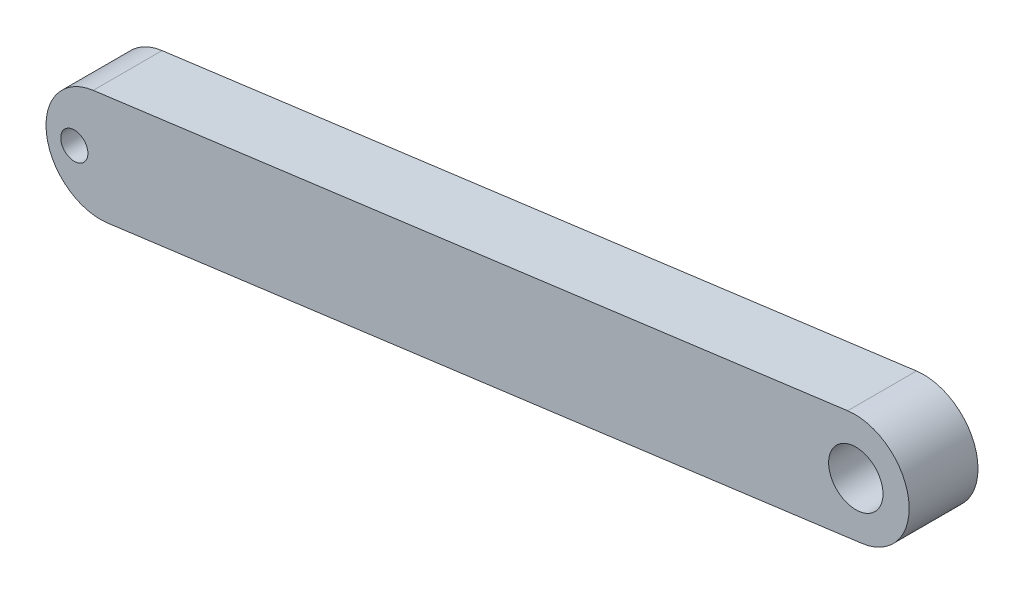
ISO-10303-21;
HEADER;
FILE_DESCRIPTION(('STEP AP214'),'2;1');
FILE_NAME('part.step','',(''),(''),'','','');
FILE_SCHEMA(('AUTOMOTIVE_DESIGN { 1 0 10303 214 1 1 1 1 }'));
ENDSEC;
DATA;
#1=APPLICATION_CONTEXT('core data for automotive mechanical design processes');
#2=APPLICATION_PROTOCOL_DEFINITION('international standard','automotive_design',2000,#1);
#3=PRODUCT_CONTEXT('',#1,'mechanical');
#4=PRODUCT('Part','Part','',(#3));
#5=PRODUCT_RELATED_PRODUCT_CATEGORY('part','',(#4));
#6=PRODUCT_DEFINITION_FORMATION('','',#4);
#7=PRODUCT_DEFINITION_CONTEXT('part definition',#1,'design');
#8=PRODUCT_DEFINITION('design','',#6,#7);
#9=PRODUCT_DEFINITION_SHAPE('','',#8);
#10=(LENGTH_UNIT() NAMED_UNIT(*) SI_UNIT(.MILLI.,.METRE.));
#11=(NAMED_UNIT(*) PLANE_ANGLE_UNIT() SI_UNIT($,.RADIAN.));
#12=(NAMED_UNIT(*) SI_UNIT($,.STERADIAN.) SOLID_ANGLE_UNIT());
#13=UNCERTAINTY_MEASURE_WITH_UNIT(LENGTH_MEASURE(1.E-05),#10,'distance_accuracy_value','');
#14=(GEOMETRIC_REPRESENTATION_CONTEXT(3) GLOBAL_UNCERTAINTY_ASSIGNED_CONTEXT((#13)) GLOBAL_UNIT_ASSIGNED_CONTEXT((#10,
#11,#12)) REPRESENTATION_CONTEXT('',''));
#15=CARTESIAN_POINT('',(0.,0.,0.));
#16=DIRECTION('',(0.,0.,1.));
#17=DIRECTION('',(1.,0.,0.));
#18=AXIS2_PLACEMENT_3D('',#15,#16,#17);
#19=CARTESIAN_POINT('',(4803.77362647582,-1072.12790132437,380.));
#20=DIRECTION('',(0.,0.,-1.));
#21=DIRECTION('',(-1.,0.,0.));
#22=AXIS2_PLACEMENT_3D('',#19,#20,#21);
#23=CYLINDRICAL_SURFACE('',#22,299.999999999994);
#24=CARTESIAN_POINT('',(4803.77362647582,-1072.12790132437,0.));
#25=DIRECTION('',(0.,0.,1.));
#26=DIRECTION('',(1.,0.,0.));
#27=AXIS2_PLACEMENT_3D('',#24,#25,#26);
#28=CIRCLE('',#27,299.999999999994);
#29=CARTESIAN_POINT('',(4843.0953105915,-1369.53974567208,0.));
#30=VERTEX_POINT('',#29);
#31=CARTESIAN_POINT('',(4764.45194236014,-774.716056976667,0.));
#32=VERTEX_POINT('',#31);
#33=EDGE_CURVE('E102',#30,#32,#28,.T.);
#34=ORIENTED_EDGE('',*,*,#33,.T.);
#35=DIRECTION('',(0.,0.,-1.));
#36=VECTOR('',#35,1.);
#37=CARTESIAN_POINT('',(4764.45194236014,-774.716056976667,380.));
#38=LINE('',#37,#36);
#39=CARTESIAN_POINT('',(4764.45194236014,-774.716056976667,380.));
#40=VERTEX_POINT('',#39);
#41=EDGE_CURVE('E11',#40,#32,#38,.T.);
#42=ORIENTED_EDGE('',*,*,#41,.F.);
#43=CARTESIAN_POINT('',(4803.77362647582,-1072.12790132437,380.));
#44=DIRECTION('',(0.,0.,1.));
#45=DIRECTION('',(1.,0.,0.));
#46=AXIS2_PLACEMENT_3D('',#43,#44,#45);
#47=CIRCLE('',#46,299.999999999994);
#48=CARTESIAN_POINT('',(4843.0953105915,-1369.53974567208,380.));
#49=VERTEX_POINT('',#48);
#50=EDGE_CURVE('E88',#49,#40,#47,.T.);
#51=ORIENTED_EDGE('',*,*,#50,.F.);
#52=DIRECTION('',(0.,0.,-1.));
#53=VECTOR('',#52,1.);
#54=CARTESIAN_POINT('',(4843.0953105915,-1369.53974567208,380.));
#55=LINE('',#54,#53);
#56=EDGE_CURVE('E55',#49,#30,#55,.T.);
#57=ORIENTED_EDGE('',*,*,#56,.T.);
#58=EDGE_LOOP('',(#34,#42,#51,#57));
#59=FACE_BOUND('',#58,.T.);
#60=ADVANCED_FACE('F39',(#59),#23,.T.);
#61=CARTESIAN_POINT('',(4764.45194236014,-774.716056976667,380.));
#62=DIRECTION('',(0.1310722803856,-0.991372814492368,0.));
#63=DIRECTION('',(0.991372814492368,0.1310722803856,0.));
#64=AXIS2_PLACEMENT_3D('',#61,#62,#63);
#65=PLANE('',#64);
#66=DIRECTION('',(-0.991372814492368,-0.1310722803856,0.));
#67=VECTOR('',#66,1.);
#68=CARTESIAN_POINT('',(4764.45194236014,-774.716056976667,0.));
#69=LINE('',#68,#67);
#70=CARTESIAN_POINT('',(600.686121492195,-1325.21963459619,0.));
#71=VERTEX_POINT('',#70);
#72=EDGE_CURVE('E93',#32,#71,#69,.T.);
#73=ORIENTED_EDGE('',*,*,#72,.T.);
#74=DIRECTION('',(0.,0.,-1.));
#75=VECTOR('',#74,1.);
#76=CARTESIAN_POINT('',(600.686121492195,-1325.21963459619,380.));
#77=LINE('',#76,#75);
#78=CARTESIAN_POINT('',(600.686121492195,-1325.21963459619,380.));
#79=VERTEX_POINT('',#78);
#80=EDGE_CURVE('E47',#79,#71,#77,.T.);
#81=ORIENTED_EDGE('',*,*,#80,.F.);
#82=DIRECTION('',(-0.991372814492368,-0.1310722803856,0.));
#83=VECTOR('',#82,1.);
#84=CARTESIAN_POINT('',(4764.45194236014,-774.716056976667,380.));
#85=LINE('',#84,#83);
#86=EDGE_CURVE('E81',#40,#79,#85,.T.);
#87=ORIENTED_EDGE('',*,*,#86,.F.);
#88=ORIENTED_EDGE('',*,*,#41,.T.);
#89=EDGE_LOOP('',(#73,#81,#87,#88));
#90=FACE_BOUND('',#89,.T.);
#91=ADVANCED_FACE('F92',(#90),#65,.F.);
#92=CARTESIAN_POINT('',(640.007805607875,-1622.63147894389,380.));
#93=DIRECTION('',(0.,0.,-1.));
#94=DIRECTION('',(-1.,0.,0.));
#95=AXIS2_PLACEMENT_3D('',#92,#93,#94);
#96=CYLINDRICAL_SURFACE('',#95,299.999999999994);
#97=CARTESIAN_POINT('',(640.007805607875,-1622.63147894389,0.));
#98=DIRECTION('',(0.,0.,1.));
#99=DIRECTION('',(1.,0.,0.));
#100=AXIS2_PLACEMENT_3D('',#97,#98,#99);
#101=CIRCLE('',#100,299.999999999994);
#102=CARTESIAN_POINT('',(679.329489723554,-1920.0433232916,0.));
#103=VERTEX_POINT('',#102);
#104=EDGE_CURVE('E106',#71,#103,#101,.T.);
#105=ORIENTED_EDGE('',*,*,#104,.T.);
#106=DIRECTION('',(0.,0.,-1.));
#107=VECTOR('',#106,1.);
#108=CARTESIAN_POINT('',(679.329489723554,-1920.0433232916,380.));
#109=LINE('',#108,#107);
#110=CARTESIAN_POINT('',(679.329489723554,-1920.0433232916,380.));
#111=VERTEX_POINT('',#110);
#112=EDGE_CURVE('E70',#111,#103,#109,.T.);
#113=ORIENTED_EDGE('',*,*,#112,.F.);
#114=CARTESIAN_POINT('',(640.007805607875,-1622.63147894389,380.));
#115=DIRECTION('',(0.,0.,1.));
#116=DIRECTION('',(1.,0.,0.));
#117=AXIS2_PLACEMENT_3D('',#114,#115,#116);
#118=CIRCLE('',#117,299.999999999994);
#119=EDGE_CURVE('E87',#79,#111,#118,.T.);
#120=ORIENTED_EDGE('',*,*,#119,.F.);
#121=ORIENTED_EDGE('',*,*,#80,.T.);
#122=EDGE_LOOP('',(#105,#113,#120,#121));
#123=FACE_BOUND('',#122,.T.);
#124=ADVANCED_FACE('F96',(#123),#96,.T.);
#125=CARTESIAN_POINT('',(4843.0953105915,-1369.53974567208,380.));
#126=DIRECTION('',(0.1310722803856,-0.991372814492368,0.));
#127=DIRECTION('',(0.991372814492368,0.1310722803856,0.));
#128=AXIS2_PLACEMENT_3D('',#125,#126,#127);
#129=PLANE('',#128);
#130=DIRECTION('',(-0.991372814492368,-0.1310722803856,0.));
#131=VECTOR('',#130,1.);
#132=CARTESIAN_POINT('',(4843.0953105915,-1369.53974567208,0.));
#133=LINE('',#132,#131);
#134=EDGE_CURVE('E108',#30,#103,#133,.T.);
#135=ORIENTED_EDGE('',*,*,#134,.F.);
#136=ORIENTED_EDGE('',*,*,#56,.F.);
#137=DIRECTION('',(-0.991372814492368,-0.1310722803856,0.));
#138=VECTOR('',#137,1.);
#139=CARTESIAN_POINT('',(4843.0953105915,-1369.53974567208,380.));
#140=LINE('',#139,#138);
#141=EDGE_CURVE('E97',#49,#111,#140,.T.);
#142=ORIENTED_EDGE('',*,*,#141,.T.);
#143=ORIENTED_EDGE('',*,*,#112,.T.);
#144=EDGE_LOOP('',(#135,#136,#142,#143));
#145=FACE_BOUND('',#144,.T.);
#146=ADVANCED_FACE('F138',(#145),#129,.T.);
#147=CARTESIAN_POINT('',(4803.77362647582,-1072.12790132437,380.));
#148=DIRECTION('',(0.,0.,1.));
#149=DIRECTION('',(1.,0.,0.));
#150=AXIS2_PLACEMENT_3D('',#147,#148,#149);
#151=PLANE('',#150);
#152=CARTESIAN_POINT('',(496.308780646527,-1641.63034457298,380.));
#153=DIRECTION('',(0.,0.,1.));
#154=DIRECTION('',(1.,0.,0.));
#155=AXIS2_PLACEMENT_3D('',#152,#153,#154);
#156=CIRCLE('',#155,75.);
#157=CARTESIAN_POINT('',(571.308780646527,-1641.63034457298,380.));
#158=VERTEX_POINT('',#157);
#159=EDGE_CURVE('E120',#158,#158,#156,.T.);
#160=ORIENTED_EDGE('',*,*,#159,.F.);
#161=EDGE_LOOP('',(#160));
#162=FACE_BOUND('',#161,.T.);
#163=CARTESIAN_POINT('',(4809.30877454638,-1075.47572556868,380.));
#164=DIRECTION('',(0.,0.,1.));
#165=DIRECTION('',(1.,0.,0.));
#166=AXIS2_PLACEMENT_3D('',#163,#164,#165);
#167=CIRCLE('',#166,149.999999999886);
#168=CARTESIAN_POINT('',(4959.30877454626,-1075.47572556868,380.));
#169=VERTEX_POINT('',#168);
#170=EDGE_CURVE('E114',#169,#169,#167,.T.);
#171=ORIENTED_EDGE('',*,*,#170,.F.);
#172=EDGE_LOOP('',(#171));
#173=FACE_BOUND('',#172,.T.);
#174=ORIENTED_EDGE('',*,*,#50,.T.);
#175=ORIENTED_EDGE('',*,*,#86,.T.);
#176=ORIENTED_EDGE('',*,*,#119,.T.);
#177=ORIENTED_EDGE('',*,*,#141,.F.);
#178=EDGE_LOOP('',(#174,#175,#176,#177));
#179=FACE_BOUND('',#178,.T.);
#180=ADVANCED_FACE('F84',(#162,#173,#179),#151,.T.);
#181=CARTESIAN_POINT('',(4803.77362647582,-1072.12790132437,0.));
#182=DIRECTION('',(0.,0.,1.));
#183=DIRECTION('',(1.,0.,0.));
#184=AXIS2_PLACEMENT_3D('',#181,#182,#183);
#185=PLANE('',#184);
#186=CARTESIAN_POINT('',(496.308780646527,-1641.63034457298,0.));
#187=DIRECTION('',(0.,0.,1.));
#188=DIRECTION('',(1.,0.,0.));
#189=AXIS2_PLACEMENT_3D('',#186,#187,#188);
#190=CIRCLE('',#189,75.);
#191=CARTESIAN_POINT('',(571.308780646527,-1641.63034457298,0.));
#192=VERTEX_POINT('',#191);
#193=EDGE_CURVE('E117',#192,#192,#190,.T.);
#194=ORIENTED_EDGE('',*,*,#193,.T.);
#195=EDGE_LOOP('',(#194));
#196=FACE_BOUND('',#195,.T.);
#197=CARTESIAN_POINT('',(4809.30877454638,-1075.47572556868,0.));
#198=DIRECTION('',(0.,0.,1.));
#199=DIRECTION('',(1.,0.,0.));
#200=AXIS2_PLACEMENT_3D('',#197,#198,#199);
#201=CIRCLE('',#200,149.999999999886);
#202=CARTESIAN_POINT('',(4959.30877454626,-1075.47572556868,0.));
#203=VERTEX_POINT('',#202);
#204=EDGE_CURVE('E104',#203,#203,#201,.T.);
#205=ORIENTED_EDGE('',*,*,#204,.T.);
#206=EDGE_LOOP('',(#205));
#207=FACE_BOUND('',#206,.T.);
#208=ORIENTED_EDGE('',*,*,#33,.F.);
#209=ORIENTED_EDGE('',*,*,#134,.T.);
#210=ORIENTED_EDGE('',*,*,#104,.F.);
#211=ORIENTED_EDGE('',*,*,#72,.F.);
#212=EDGE_LOOP('',(#208,#209,#210,#211));
#213=FACE_BOUND('',#212,.T.);
#214=ADVANCED_FACE('F126',(#196,#207,#213),#185,.F.);
#215=CARTESIAN_POINT('',(4809.30877454638,-1075.47572556868,0.));
#216=DIRECTION('',(0.,0.,1.));
#217=DIRECTION('',(1.,0.,0.));
#218=AXIS2_PLACEMENT_3D('',#215,#216,#217);
#219=CYLINDRICAL_SURFACE('',#218,149.999999999886);
#220=ORIENTED_EDGE('',*,*,#204,.F.);
#221=EDGE_LOOP('',(#220));
#222=FACE_BOUND('',#221,.T.);
#223=ORIENTED_EDGE('',*,*,#170,.T.);
#224=EDGE_LOOP('',(#223));
#225=FACE_BOUND('',#224,.T.);
#226=ADVANCED_FACE('F132',(#222,#225),#219,.F.);
#227=CARTESIAN_POINT('',(496.308780646527,-1641.63034457298,0.));
#228=DIRECTION('',(0.,0.,1.));
#229=DIRECTION('',(1.,0.,0.));
#230=AXIS2_PLACEMENT_3D('',#227,#228,#229);
#231=CYLINDRICAL_SURFACE('',#230,75.);
#232=ORIENTED_EDGE('',*,*,#193,.F.);
#233=EDGE_LOOP('',(#232));
#234=FACE_BOUND('',#233,.T.);
#235=ORIENTED_EDGE('',*,*,#159,.T.);
#236=EDGE_LOOP('',(#235));
#237=FACE_BOUND('',#236,.T.);
#238=ADVANCED_FACE('F129',(#234,#237),#231,.F.);
#239=CLOSED_SHELL('',(#60,#91,#124,#146,#180,#214,#226,#238));
#240=MANIFOLD_SOLID_BREP('B2',#239);
#241=ADVANCED_BREP_SHAPE_REPRESENTATION('',(#18,#240),#14);
#242=SHAPE_DEFINITION_REPRESENTATION(#9,#241);
ENDSEC;
END-ISO-10303-21;
